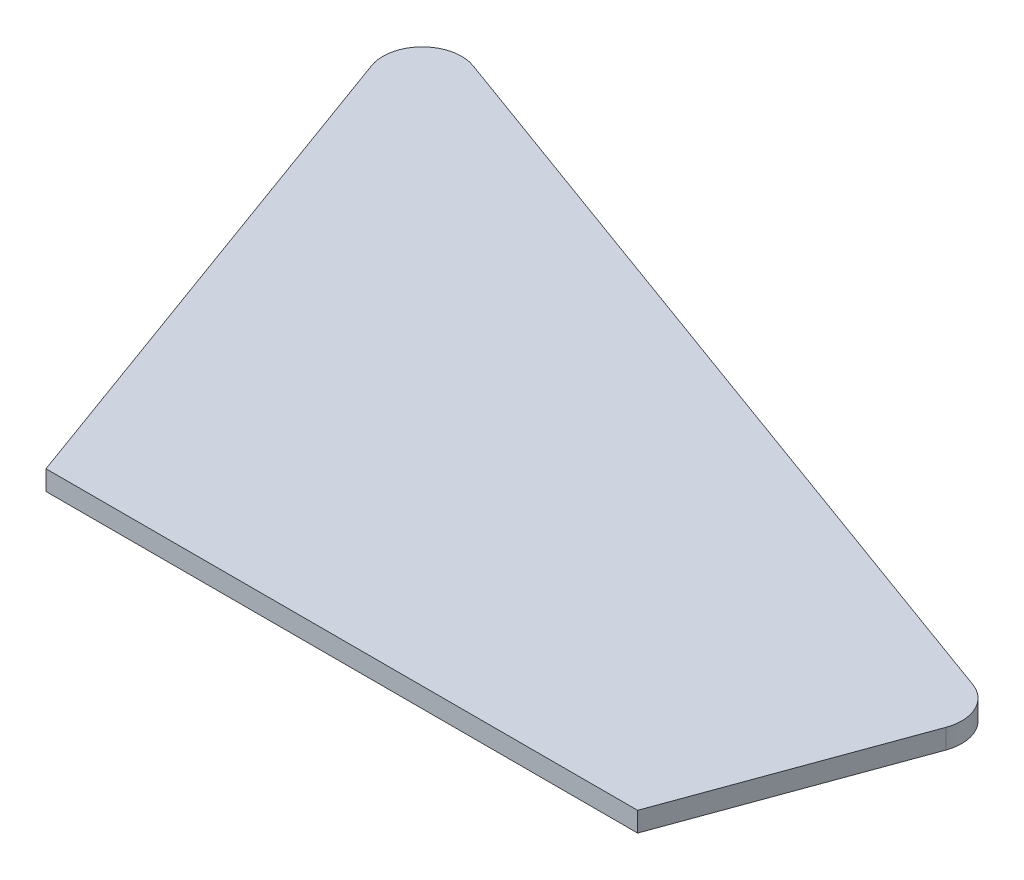
ISO-10303-21;
HEADER;
FILE_DESCRIPTION(('STEP AP214'),'2;1');
FILE_NAME('part.step','',(''),(''),'','','');
FILE_SCHEMA(('AUTOMOTIVE_DESIGN { 1 0 10303 214 1 1 1 1 }'));
ENDSEC;
DATA;
#1=APPLICATION_CONTEXT('core data for automotive mechanical design processes');
#2=APPLICATION_PROTOCOL_DEFINITION('international standard','automotive_design',2000,#1);
#3=PRODUCT_CONTEXT('',#1,'mechanical');
#4=PRODUCT('Part','Part','',(#3));
#5=PRODUCT_RELATED_PRODUCT_CATEGORY('part','',(#4));
#6=PRODUCT_DEFINITION_FORMATION('','',#4);
#7=PRODUCT_DEFINITION_CONTEXT('part definition',#1,'design');
#8=PRODUCT_DEFINITION('design','',#6,#7);
#9=PRODUCT_DEFINITION_SHAPE('','',#8);
#10=(LENGTH_UNIT() NAMED_UNIT(*) SI_UNIT(.MILLI.,.METRE.));
#11=(NAMED_UNIT(*) PLANE_ANGLE_UNIT() SI_UNIT($,.RADIAN.));
#12=(NAMED_UNIT(*) SI_UNIT($,.STERADIAN.) SOLID_ANGLE_UNIT());
#13=UNCERTAINTY_MEASURE_WITH_UNIT(LENGTH_MEASURE(1.E-05),#10,'distance_accuracy_value','');
#14=(GEOMETRIC_REPRESENTATION_CONTEXT(3) GLOBAL_UNCERTAINTY_ASSIGNED_CONTEXT((#13)) GLOBAL_UNIT_ASSIGNED_CONTEXT((#10,
#11,#12)) REPRESENTATION_CONTEXT('',''));
#15=CARTESIAN_POINT('',(0.,0.,0.));
#16=DIRECTION('',(0.,0.,1.));
#17=DIRECTION('',(1.,0.,0.));
#18=AXIS2_PLACEMENT_3D('',#15,#16,#17);
#19=CARTESIAN_POINT('',(-39.8645550389547,0.,-24.653685629797));
#20=DIRECTION('',(0.,1.,0.));
#21=DIRECTION('',(0.,0.,1.));
#22=AXIS2_PLACEMENT_3D('',#19,#20,#21);
#23=PLANE('',#22);
#24=DIRECTION('',(0.342020143325669,0.,0.939692620785908));
#25=VECTOR('',#24,1.);
#26=CARTESIAN_POINT('',(-24.7189697233885,0.,28.6536856297971));
#27=LINE('',#26,#25);
#28=CARTESIAN_POINT('',(-43.6233255220983,0.,-23.2856050564943));
#29=VERTEX_POINT('',#28);
#30=CARTESIAN_POINT('',(-24.7189697233885,0.,28.6536856297971));
#31=VERTEX_POINT('',#30);
#32=EDGE_CURVE('E145',#29,#31,#27,.T.);
#33=ORIENTED_EDGE('',*,*,#32,.F.);
#34=CARTESIAN_POINT('',(-39.8645550389547,0.,-24.653685629797));
#35=DIRECTION('',(0.,1.,0.));
#36=DIRECTION('',(0.,0.,1.));
#37=AXIS2_PLACEMENT_3D('',#34,#35,#36);
#38=CIRCLE('',#37,4.00000000000001);
#39=CARTESIAN_POINT('',(-38.4964744656519,0.,-28.4124561129406));
#40=VERTEX_POINT('',#39);
#41=EDGE_CURVE('E158',#40,#29,#38,.T.);
#42=ORIENTED_EDGE('',*,*,#41,.F.);
#43=DIRECTION('',(-0.939692620785906,0.,-0.342020143325676));
#44=VECTOR('',#43,1.);
#45=CARTESIAN_POINT('',(1.36808057330268,0.,-13.902944676494));
#46=LINE('',#45,#44);
#47=CARTESIAN_POINT('',(41.2326356122574,0.,0.606566759952607));
#48=VERTEX_POINT('',#47);
#49=EDGE_CURVE('E175',#48,#40,#46,.T.);
#50=ORIENTED_EDGE('',*,*,#49,.F.);
#51=CARTESIAN_POINT('',(39.8645550389547,0.,4.36533724309623));
#52=DIRECTION('',(0.,1.,0.));
#53=DIRECTION('',(0.,0.,-1.));
#54=AXIS2_PLACEMENT_3D('',#51,#52,#53);
#55=CIRCLE('',#54,3.99999999999999);
#56=CARTESIAN_POINT('',(43.6233255220983,0.,5.73341781639897));
#57=VERTEX_POINT('',#56);
#58=EDGE_CURVE('E172',#57,#48,#55,.T.);
#59=ORIENTED_EDGE('',*,*,#58,.F.);
#60=DIRECTION('',(0.342020143325677,0.,-0.939692620785905));
#61=VECTOR('',#60,1.);
#62=CARTESIAN_POINT('',(35.2810302766115,0.,28.6536856297971));
#63=LINE('',#62,#61);
#64=CARTESIAN_POINT('',(35.2810302766115,0.,28.6536856297971));
#65=VERTEX_POINT('',#64);
#66=EDGE_CURVE('E170',#65,#57,#63,.T.);
#67=ORIENTED_EDGE('',*,*,#66,.F.);
#68=DIRECTION('',(1.,0.,0.));
#69=VECTOR('',#68,1.);
#70=CARTESIAN_POINT('',(-24.7189697233885,0.,28.6536856297971));
#71=LINE('',#70,#69);
#72=EDGE_CURVE('E148',#31,#65,#71,.T.);
#73=ORIENTED_EDGE('',*,*,#72,.F.);
#74=EDGE_LOOP('',(#33,#42,#50,#59,#67,#73));
#75=FACE_BOUND('',#74,.T.);
#76=DIRECTION('',(-1.,0.,0.));
#77=VECTOR('',#76,1.);
#78=CARTESIAN_POINT('',(32.8303038928775,0.,25.1536856297971));
#79=LINE('',#78,#77);
#80=CARTESIAN_POINT('',(32.8303038928775,0.,25.1536856297971));
#81=VERTEX_POINT('',#80);
#82=CARTESIAN_POINT('',(-22.2682433396545,0.,25.1536856297971));
#83=VERTEX_POINT('',#82);
#84=EDGE_CURVE('E51',#81,#83,#79,.T.);
#85=ORIENTED_EDGE('',*,*,#84,.F.);
#86=DIRECTION('',(-0.342020143325677,0.,0.939692620785905));
#87=VECTOR('',#86,1.);
#88=CARTESIAN_POINT('',(40.3344013493477,0.,4.53634731475907));
#89=LINE('',#88,#87);
#90=CARTESIAN_POINT('',(40.3344013493477,0.,4.53634731475907));
#91=VERTEX_POINT('',#90);
#92=EDGE_CURVE('E55',#91,#81,#89,.T.);
#93=ORIENTED_EDGE('',*,*,#92,.F.);
#94=CARTESIAN_POINT('',(39.8645550389547,0.,4.36533724309623));
#95=DIRECTION('',(0.,-1.,0.));
#96=DIRECTION('',(0.,0.,-1.));
#97=AXIS2_PLACEMENT_3D('',#94,#95,#96);
#98=CIRCLE('',#97,0.49999999999999);
#99=CARTESIAN_POINT('',(40.0355651106175,0.,3.89549093270329));
#100=VERTEX_POINT('',#99);
#101=EDGE_CURVE('E351',#100,#91,#98,.T.);
#102=ORIENTED_EDGE('',*,*,#101,.F.);
#103=DIRECTION('',(0.939692620785906,0.,0.342020143325676));
#104=VECTOR('',#103,1.);
#105=CARTESIAN_POINT('',(-39.6935449672919,0.,-25.12353194019));
#106=LINE('',#105,#104);
#107=CARTESIAN_POINT('',(-39.6935449672919,0.,-25.12353194019));
#108=VERTEX_POINT('',#107);
#109=EDGE_CURVE('E366',#108,#100,#106,.T.);
#110=ORIENTED_EDGE('',*,*,#109,.F.);
#111=CARTESIAN_POINT('',(-39.8645550389547,0.,-24.653685629797));
#112=DIRECTION('',(0.,-1.,0.));
#113=DIRECTION('',(0.,0.,-1.));
#114=AXIS2_PLACEMENT_3D('',#111,#112,#113);
#115=CIRCLE('',#114,0.500000000000003);
#116=CARTESIAN_POINT('',(-40.3344013493477,0.,-24.4826755581341));
#117=VERTEX_POINT('',#116);
#118=EDGE_CURVE('E369',#117,#108,#115,.T.);
#119=ORIENTED_EDGE('',*,*,#118,.F.);
#120=DIRECTION('',(-0.342020143325669,0.,-0.939692620785908));
#121=VECTOR('',#120,1.);
#122=CARTESIAN_POINT('',(-22.2682433396545,0.,25.1536856297971));
#123=LINE('',#122,#121);
#124=EDGE_CURVE('E370',#83,#117,#123,.T.);
#125=ORIENTED_EDGE('',*,*,#124,.F.);
#126=EDGE_LOOP('',(#85,#93,#102,#110,#119,#125));
#127=FACE_BOUND('',#126,.T.);
#128=ADVANCED_FACE('F36',(#75,#127),#23,.F.);
#129=CARTESIAN_POINT('',(-24.7189697233885,2.,28.6536856297971));
#130=DIRECTION('',(0.939692620785908,0.,-0.342020143325669));
#131=DIRECTION('',(-0.342020143325669,0.,-0.939692620785908));
#132=AXIS2_PLACEMENT_3D('',#129,#130,#131);
#133=PLANE('',#132);
#134=ORIENTED_EDGE('',*,*,#32,.T.);
#135=DIRECTION('',(0.,-1.,0.));
#136=VECTOR('',#135,1.);
#137=CARTESIAN_POINT('',(-24.7189697233885,2.,28.6536856297971));
#138=LINE('',#137,#136);
#139=CARTESIAN_POINT('',(-24.7189697233885,2.,28.6536856297971));
#140=VERTEX_POINT('',#139);
#141=EDGE_CURVE('E11',#140,#31,#138,.T.);
#142=ORIENTED_EDGE('',*,*,#141,.F.);
#143=DIRECTION('',(0.342020143325669,0.,0.939692620785908));
#144=VECTOR('',#143,1.);
#145=CARTESIAN_POINT('',(-24.7189697233885,2.,28.6536856297971));
#146=LINE('',#145,#144);
#147=CARTESIAN_POINT('',(-43.6233255220983,2.,-23.2856050564943));
#148=VERTEX_POINT('',#147);
#149=EDGE_CURVE('E154',#148,#140,#146,.T.);
#150=ORIENTED_EDGE('',*,*,#149,.F.);
#151=DIRECTION('',(0.,-1.,0.));
#152=VECTOR('',#151,1.);
#153=CARTESIAN_POINT('',(-43.6233255220983,2.,-23.2856050564943));
#154=LINE('',#153,#152);
#155=EDGE_CURVE('E167',#148,#29,#154,.T.);
#156=ORIENTED_EDGE('',*,*,#155,.T.);
#157=EDGE_LOOP('',(#134,#142,#150,#156));
#158=FACE_BOUND('',#157,.T.);
#159=ADVANCED_FACE('F38',(#158),#133,.F.);
#160=CARTESIAN_POINT('',(-24.7189697233885,2.,28.6536856297971));
#161=DIRECTION('',(0.,0.,-1.));
#162=DIRECTION('',(-1.,0.,0.));
#163=AXIS2_PLACEMENT_3D('',#160,#161,#162);
#164=PLANE('',#163);
#165=ORIENTED_EDGE('',*,*,#72,.T.);
#166=DIRECTION('',(0.,-1.,0.));
#167=VECTOR('',#166,1.);
#168=CARTESIAN_POINT('',(35.2810302766115,2.,28.6536856297971));
#169=LINE('',#168,#167);
#170=CARTESIAN_POINT('',(35.2810302766115,2.,28.6536856297971));
#171=VERTEX_POINT('',#170);
#172=EDGE_CURVE('E44',#171,#65,#169,.T.);
#173=ORIENTED_EDGE('',*,*,#172,.F.);
#174=DIRECTION('',(1.,0.,0.));
#175=VECTOR('',#174,1.);
#176=CARTESIAN_POINT('',(-24.7189697233885,2.,28.6536856297971));
#177=LINE('',#176,#175);
#178=EDGE_CURVE('E157',#140,#171,#177,.T.);
#179=ORIENTED_EDGE('',*,*,#178,.F.);
#180=ORIENTED_EDGE('',*,*,#141,.T.);
#181=EDGE_LOOP('',(#165,#173,#179,#180));
#182=FACE_BOUND('',#181,.T.);
#183=ADVANCED_FACE('F214',(#182),#164,.F.);
#184=CARTESIAN_POINT('',(35.2810302766115,2.,28.6536856297971));
#185=DIRECTION('',(-0.939692620785905,0.,-0.342020143325677));
#186=DIRECTION('',(-0.342020143325677,0.,0.939692620785905));
#187=AXIS2_PLACEMENT_3D('',#184,#185,#186);
#188=PLANE('',#187);
#189=ORIENTED_EDGE('',*,*,#66,.T.);
#190=DIRECTION('',(0.,-1.,0.));
#191=VECTOR('',#190,1.);
#192=CARTESIAN_POINT('',(43.6233255220983,2.,5.73341781639897));
#193=LINE('',#192,#191);
#194=CARTESIAN_POINT('',(43.6233255220983,2.,5.73341781639897));
#195=VERTEX_POINT('',#194);
#196=EDGE_CURVE('E186',#195,#57,#193,.T.);
#197=ORIENTED_EDGE('',*,*,#196,.F.);
#198=DIRECTION('',(0.342020143325677,0.,-0.939692620785905));
#199=VECTOR('',#198,1.);
#200=CARTESIAN_POINT('',(35.2810302766115,2.,28.6536856297971));
#201=LINE('',#200,#199);
#202=EDGE_CURVE('E160',#171,#195,#201,.T.);
#203=ORIENTED_EDGE('',*,*,#202,.F.);
#204=ORIENTED_EDGE('',*,*,#172,.T.);
#205=EDGE_LOOP('',(#189,#197,#203,#204));
#206=FACE_BOUND('',#205,.T.);
#207=ADVANCED_FACE('F193',(#206),#188,.F.);
#208=CARTESIAN_POINT('',(39.8645550389547,2.,4.36533724309623));
#209=DIRECTION('',(0.,-1.,0.));
#210=DIRECTION('',(0.,0.,-1.));
#211=AXIS2_PLACEMENT_3D('',#208,#209,#210);
#212=CYLINDRICAL_SURFACE('',#211,3.99999999999999);
#213=ORIENTED_EDGE('',*,*,#58,.T.);
#214=DIRECTION('',(0.,-1.,0.));
#215=VECTOR('',#214,1.);
#216=CARTESIAN_POINT('',(41.2326356122574,2.,0.606566759952607));
#217=LINE('',#216,#215);
#218=CARTESIAN_POINT('',(41.2326356122574,2.,0.606566759952607));
#219=VERTEX_POINT('',#218);
#220=EDGE_CURVE('E183',#219,#48,#217,.T.);
#221=ORIENTED_EDGE('',*,*,#220,.F.);
#222=CARTESIAN_POINT('',(39.8645550389547,2.,4.36533724309623));
#223=DIRECTION('',(0.,1.,0.));
#224=DIRECTION('',(0.,0.,-1.));
#225=AXIS2_PLACEMENT_3D('',#222,#223,#224);
#226=CIRCLE('',#225,3.99999999999999);
#227=EDGE_CURVE('E162',#195,#219,#226,.T.);
#228=ORIENTED_EDGE('',*,*,#227,.F.);
#229=ORIENTED_EDGE('',*,*,#196,.T.);
#230=EDGE_LOOP('',(#213,#221,#228,#229));
#231=FACE_BOUND('',#230,.T.);
#232=ADVANCED_FACE('F202',(#231),#212,.T.);
#233=CARTESIAN_POINT('',(1.36808057330268,2.,-13.902944676494));
#234=DIRECTION('',(-0.342020143325676,0.,0.939692620785906));
#235=DIRECTION('',(0.939692620785906,0.,0.342020143325676));
#236=AXIS2_PLACEMENT_3D('',#233,#234,#235);
#237=PLANE('',#236);
#238=ORIENTED_EDGE('',*,*,#49,.T.);
#239=DIRECTION('',(0.,-1.,0.));
#240=VECTOR('',#239,1.);
#241=CARTESIAN_POINT('',(-38.4964744656519,2.,-28.4124561129406));
#242=LINE('',#241,#240);
#243=CARTESIAN_POINT('',(-38.4964744656519,2.,-28.4124561129406));
#244=VERTEX_POINT('',#243);
#245=EDGE_CURVE('E180',#244,#40,#242,.T.);
#246=ORIENTED_EDGE('',*,*,#245,.F.);
#247=DIRECTION('',(-0.939692620785906,0.,-0.342020143325676));
#248=VECTOR('',#247,1.);
#249=CARTESIAN_POINT('',(1.36808057330268,2.,-13.902944676494));
#250=LINE('',#249,#248);
#251=EDGE_CURVE('E164',#219,#244,#250,.T.);
#252=ORIENTED_EDGE('',*,*,#251,.F.);
#253=ORIENTED_EDGE('',*,*,#220,.T.);
#254=EDGE_LOOP('',(#238,#246,#252,#253));
#255=FACE_BOUND('',#254,.T.);
#256=ADVANCED_FACE('F206',(#255),#237,.F.);
#257=CARTESIAN_POINT('',(-39.8645550389547,2.,-24.653685629797));
#258=DIRECTION('',(0.,-1.,0.));
#259=DIRECTION('',(0.,0.,-1.));
#260=AXIS2_PLACEMENT_3D('',#257,#258,#259);
#261=CYLINDRICAL_SURFACE('',#260,4.00000000000001);
#262=ORIENTED_EDGE('',*,*,#41,.T.);
#263=ORIENTED_EDGE('',*,*,#155,.F.);
#264=CARTESIAN_POINT('',(-39.8645550389547,2.,-24.653685629797));
#265=DIRECTION('',(0.,1.,0.));
#266=DIRECTION('',(0.,0.,1.));
#267=AXIS2_PLACEMENT_3D('',#264,#265,#266);
#268=CIRCLE('',#267,4.00000000000001);
#269=EDGE_CURVE('E166',#244,#148,#268,.T.);
#270=ORIENTED_EDGE('',*,*,#269,.F.);
#271=ORIENTED_EDGE('',*,*,#245,.T.);
#272=EDGE_LOOP('',(#262,#263,#270,#271));
#273=FACE_BOUND('',#272,.T.);
#274=ADVANCED_FACE('F217',(#273),#261,.T.);
#275=CARTESIAN_POINT('',(-39.8645550389547,2.,-24.653685629797));
#276=DIRECTION('',(0.,1.,0.));
#277=DIRECTION('',(0.,0.,1.));
#278=AXIS2_PLACEMENT_3D('',#275,#276,#277);
#279=PLANE('',#278);
#280=ORIENTED_EDGE('',*,*,#149,.T.);
#281=ORIENTED_EDGE('',*,*,#178,.T.);
#282=ORIENTED_EDGE('',*,*,#202,.T.);
#283=ORIENTED_EDGE('',*,*,#227,.T.);
#284=ORIENTED_EDGE('',*,*,#251,.T.);
#285=ORIENTED_EDGE('',*,*,#269,.T.);
#286=EDGE_LOOP('',(#280,#281,#282,#283,#284,#285));
#287=FACE_BOUND('',#286,.T.);
#288=ADVANCED_FACE('F210',(#287),#279,.T.);
#289=CARTESIAN_POINT('',(32.8303038928775,-2.,25.1536856297971));
#290=DIRECTION('',(0.,0.,-1.));
#291=DIRECTION('',(-1.,0.,0.));
#292=AXIS2_PLACEMENT_3D('',#289,#290,#291);
#293=PLANE('',#292);
#294=ORIENTED_EDGE('',*,*,#84,.T.);
#295=DIRECTION('',(0.,1.,0.));
#296=VECTOR('',#295,1.);
#297=CARTESIAN_POINT('',(-22.2682433396545,-2.,25.1536856297971));
#298=LINE('',#297,#296);
#299=CARTESIAN_POINT('',(-22.2682433396545,-2.,25.1536856297971));
#300=VERTEX_POINT('',#299);
#301=EDGE_CURVE('E128',#300,#83,#298,.T.);
#302=ORIENTED_EDGE('',*,*,#301,.F.);
#303=DIRECTION('',(-1.,0.,0.));
#304=VECTOR('',#303,1.);
#305=CARTESIAN_POINT('',(32.8303038928775,-2.,25.1536856297971));
#306=LINE('',#305,#304);
#307=CARTESIAN_POINT('',(32.8303038928775,-2.,25.1536856297971));
#308=VERTEX_POINT('',#307);
#309=EDGE_CURVE('E134',#308,#300,#306,.T.);
#310=ORIENTED_EDGE('',*,*,#309,.F.);
#311=DIRECTION('',(0.,1.,0.));
#312=VECTOR('',#311,1.);
#313=CARTESIAN_POINT('',(32.8303038928775,-2.,25.1536856297971));
#314=LINE('',#313,#312);
#315=EDGE_CURVE('E348',#308,#81,#314,.T.);
#316=ORIENTED_EDGE('',*,*,#315,.T.);
#317=EDGE_LOOP('',(#294,#302,#310,#316));
#318=FACE_BOUND('',#317,.T.);
#319=ADVANCED_FACE('F144',(#318),#293,.F.);
#320=CARTESIAN_POINT('',(-22.2682433396545,-2.,25.1536856297971));
#321=DIRECTION('',(0.939692620785908,0.,-0.342020143325669));
#322=DIRECTION('',(-0.342020143325669,0.,-0.939692620785908));
#323=AXIS2_PLACEMENT_3D('',#320,#321,#322);
#324=PLANE('',#323);
#325=ORIENTED_EDGE('',*,*,#124,.T.);
#326=DIRECTION('',(0.,1.,0.));
#327=VECTOR('',#326,1.);
#328=CARTESIAN_POINT('',(-40.3344013493477,-2.,-24.4826755581341));
#329=LINE('',#328,#327);
#330=CARTESIAN_POINT('',(-40.3344013493477,-2.,-24.4826755581341));
#331=VERTEX_POINT('',#330);
#332=EDGE_CURVE('E130',#331,#117,#329,.T.);
#333=ORIENTED_EDGE('',*,*,#332,.F.);
#334=DIRECTION('',(-0.342020143325669,0.,-0.939692620785908));
#335=VECTOR('',#334,1.);
#336=CARTESIAN_POINT('',(-22.2682433396545,-2.,25.1536856297971));
#337=LINE('',#336,#335);
#338=EDGE_CURVE('E123',#300,#331,#337,.T.);
#339=ORIENTED_EDGE('',*,*,#338,.F.);
#340=ORIENTED_EDGE('',*,*,#301,.T.);
#341=EDGE_LOOP('',(#325,#333,#339,#340));
#342=FACE_BOUND('',#341,.T.);
#343=ADVANCED_FACE('F126',(#342),#324,.F.);
#344=CARTESIAN_POINT('',(-39.8645550389547,-2.,-24.653685629797));
#345=DIRECTION('',(0.,1.,0.));
#346=DIRECTION('',(0.,0.,1.));
#347=AXIS2_PLACEMENT_3D('',#344,#345,#346);
#348=CYLINDRICAL_SURFACE('',#347,0.500000000000003);
#349=ORIENTED_EDGE('',*,*,#118,.T.);
#350=DIRECTION('',(0.,1.,0.));
#351=VECTOR('',#350,1.);
#352=CARTESIAN_POINT('',(-39.6935449672919,-2.,-25.12353194019));
#353=LINE('',#352,#351);
#354=CARTESIAN_POINT('',(-39.6935449672919,-2.,-25.12353194019));
#355=VERTEX_POINT('',#354);
#356=EDGE_CURVE('E150',#355,#108,#353,.T.);
#357=ORIENTED_EDGE('',*,*,#356,.F.);
#358=CARTESIAN_POINT('',(-39.8645550389547,-2.,-24.653685629797));
#359=DIRECTION('',(0.,-1.,0.));
#360=DIRECTION('',(0.,0.,-1.));
#361=AXIS2_PLACEMENT_3D('',#358,#359,#360);
#362=CIRCLE('',#361,0.500000000000003);
#363=EDGE_CURVE('E133',#331,#355,#362,.T.);
#364=ORIENTED_EDGE('',*,*,#363,.F.);
#365=ORIENTED_EDGE('',*,*,#332,.T.);
#366=EDGE_LOOP('',(#349,#357,#364,#365));
#367=FACE_BOUND('',#366,.T.);
#368=ADVANCED_FACE('F236',(#367),#348,.T.);
#369=CARTESIAN_POINT('',(-39.6935449672919,-2.,-25.12353194019));
#370=DIRECTION('',(-0.342020143325676,0.,0.939692620785906));
#371=DIRECTION('',(0.939692620785906,0.,0.342020143325676));
#372=AXIS2_PLACEMENT_3D('',#369,#370,#371);
#373=PLANE('',#372);
#374=ORIENTED_EDGE('',*,*,#109,.T.);
#375=DIRECTION('',(0.,1.,0.));
#376=VECTOR('',#375,1.);
#377=CARTESIAN_POINT('',(40.0355651106175,-2.,3.89549093270329));
#378=LINE('',#377,#376);
#379=CARTESIAN_POINT('',(40.0355651106175,-2.,3.89549093270329));
#380=VERTEX_POINT('',#379);
#381=EDGE_CURVE('E354',#380,#100,#378,.T.);
#382=ORIENTED_EDGE('',*,*,#381,.F.);
#383=DIRECTION('',(0.939692620785906,0.,0.342020143325676));
#384=VECTOR('',#383,1.);
#385=CARTESIAN_POINT('',(-39.6935449672919,-2.,-25.12353194019));
#386=LINE('',#385,#384);
#387=EDGE_CURVE('E367',#355,#380,#386,.T.);
#388=ORIENTED_EDGE('',*,*,#387,.F.);
#389=ORIENTED_EDGE('',*,*,#356,.T.);
#390=EDGE_LOOP('',(#374,#382,#388,#389));
#391=FACE_BOUND('',#390,.T.);
#392=ADVANCED_FACE('F239',(#391),#373,.F.);
#393=CARTESIAN_POINT('',(39.8645550389547,-2.,4.36533724309623));
#394=DIRECTION('',(0.,1.,0.));
#395=DIRECTION('',(0.,0.,1.));
#396=AXIS2_PLACEMENT_3D('',#393,#394,#395);
#397=CYLINDRICAL_SURFACE('',#396,0.49999999999999);
#398=ORIENTED_EDGE('',*,*,#101,.T.);
#399=DIRECTION('',(0.,1.,0.));
#400=VECTOR('',#399,1.);
#401=CARTESIAN_POINT('',(40.3344013493477,-2.,4.53634731475907));
#402=LINE('',#401,#400);
#403=CARTESIAN_POINT('',(40.3344013493477,-2.,4.53634731475907));
#404=VERTEX_POINT('',#403);
#405=EDGE_CURVE('E350',#404,#91,#402,.T.);
#406=ORIENTED_EDGE('',*,*,#405,.F.);
#407=CARTESIAN_POINT('',(39.8645550389547,-2.,4.36533724309623));
#408=DIRECTION('',(0.,-1.,0.));
#409=DIRECTION('',(0.,0.,-1.));
#410=AXIS2_PLACEMENT_3D('',#407,#408,#409);
#411=CIRCLE('',#410,0.49999999999999);
#412=EDGE_CURVE('E356',#380,#404,#411,.T.);
#413=ORIENTED_EDGE('',*,*,#412,.F.);
#414=ORIENTED_EDGE('',*,*,#381,.T.);
#415=EDGE_LOOP('',(#398,#406,#413,#414));
#416=FACE_BOUND('',#415,.T.);
#417=ADVANCED_FACE('F243',(#416),#397,.T.);
#418=CARTESIAN_POINT('',(40.3344013493477,-2.,4.53634731475907));
#419=DIRECTION('',(-0.939692620785906,0.,-0.342020143325677));
#420=DIRECTION('',(-0.342020143325677,0.,0.939692620785906));
#421=AXIS2_PLACEMENT_3D('',#418,#419,#420);
#422=PLANE('',#421);
#423=ORIENTED_EDGE('',*,*,#92,.T.);
#424=ORIENTED_EDGE('',*,*,#315,.F.);
#425=DIRECTION('',(-0.342020143325677,0.,0.939692620785905));
#426=VECTOR('',#425,1.);
#427=CARTESIAN_POINT('',(40.3344013493477,-2.,4.53634731475907));
#428=LINE('',#427,#426);
#429=EDGE_CURVE('E139',#404,#308,#428,.T.);
#430=ORIENTED_EDGE('',*,*,#429,.F.);
#431=ORIENTED_EDGE('',*,*,#405,.T.);
#432=EDGE_LOOP('',(#423,#424,#430,#431));
#433=FACE_BOUND('',#432,.T.);
#434=ADVANCED_FACE('F247',(#433),#422,.F.);
#435=CARTESIAN_POINT('',(-39.8645550389547,-2.,-24.653685629797));
#436=DIRECTION('',(0.,-1.,0.));
#437=DIRECTION('',(0.,0.,-1.));
#438=AXIS2_PLACEMENT_3D('',#435,#436,#437);
#439=PLANE('',#438);
#440=ORIENTED_EDGE('',*,*,#309,.T.);
#441=ORIENTED_EDGE('',*,*,#338,.T.);
#442=ORIENTED_EDGE('',*,*,#363,.T.);
#443=ORIENTED_EDGE('',*,*,#387,.T.);
#444=ORIENTED_EDGE('',*,*,#412,.T.);
#445=ORIENTED_EDGE('',*,*,#429,.T.);
#446=EDGE_LOOP('',(#440,#441,#442,#443,#444,#445));
#447=FACE_BOUND('',#446,.T.);
#448=ADVANCED_FACE('F137',(#447),#439,.T.);
#449=CLOSED_SHELL('',(#128,#159,#183,#207,#232,#256,#274,#288,#319,#343,#368,#392,#417,#434,#448));
#450=MANIFOLD_SOLID_BREP('B2',#449);
#451=ADVANCED_BREP_SHAPE_REPRESENTATION('',(#18,#450),#14);
#452=SHAPE_DEFINITION_REPRESENTATION(#9,#451);
ENDSEC;
END-ISO-10303-21;
